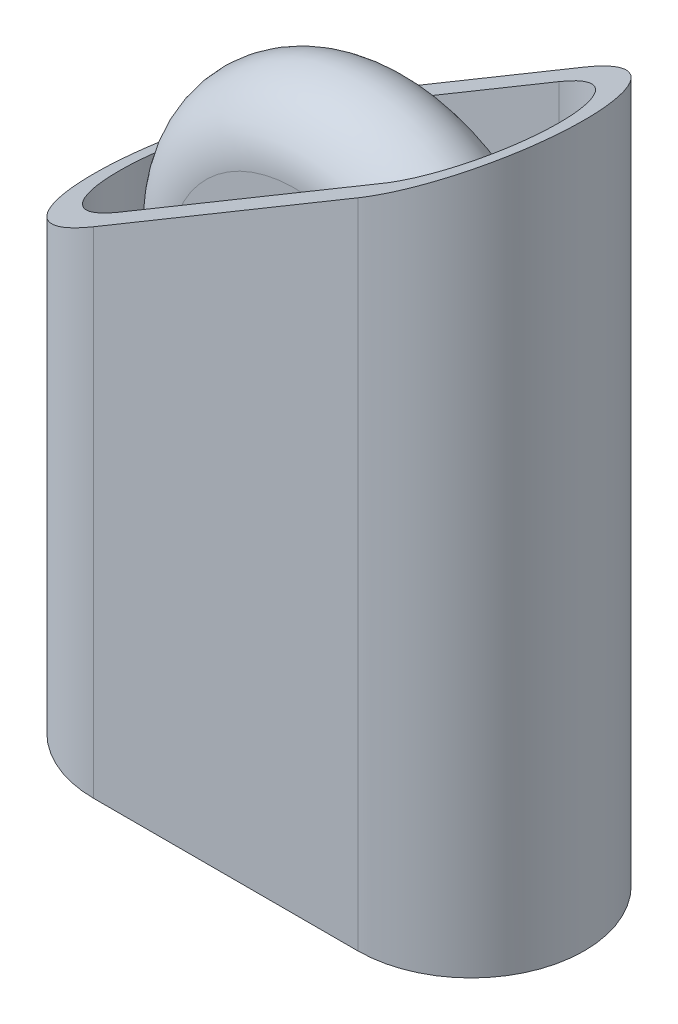
ISO-10303-21;
HEADER;
FILE_DESCRIPTION(('STEP AP214'),'2;1');
FILE_NAME('part.step','',(''),(''),'','','');
FILE_SCHEMA(('AUTOMOTIVE_DESIGN { 1 0 10303 214 1 1 1 1 }'));
ENDSEC;
DATA;
#1=APPLICATION_CONTEXT('core data for automotive mechanical design processes');
#2=APPLICATION_PROTOCOL_DEFINITION('international standard','automotive_design',2000,#1);
#3=PRODUCT_CONTEXT('',#1,'mechanical');
#4=PRODUCT('Part','Part','',(#3));
#5=PRODUCT_RELATED_PRODUCT_CATEGORY('part','',(#4));
#6=PRODUCT_DEFINITION_FORMATION('','',#4);
#7=PRODUCT_DEFINITION_CONTEXT('part definition',#1,'design');
#8=PRODUCT_DEFINITION('design','',#6,#7);
#9=PRODUCT_DEFINITION_SHAPE('','',#8);
#10=(LENGTH_UNIT() NAMED_UNIT(*) SI_UNIT(.MILLI.,.METRE.));
#11=(NAMED_UNIT(*) PLANE_ANGLE_UNIT() SI_UNIT($,.RADIAN.));
#12=(NAMED_UNIT(*) SI_UNIT($,.STERADIAN.) SOLID_ANGLE_UNIT());
#13=UNCERTAINTY_MEASURE_WITH_UNIT(LENGTH_MEASURE(1.E-05),#10,'distance_accuracy_value','');
#14=(GEOMETRIC_REPRESENTATION_CONTEXT(3) GLOBAL_UNCERTAINTY_ASSIGNED_CONTEXT((#13)) GLOBAL_UNIT_ASSIGNED_CONTEXT((#10,
#11,#12)) REPRESENTATION_CONTEXT('',''));
#15=CARTESIAN_POINT('',(0.,0.,0.));
#16=DIRECTION('',(0.,0.,1.));
#17=DIRECTION('',(1.,0.,0.));
#18=AXIS2_PLACEMENT_3D('',#15,#16,#17);
#19=CARTESIAN_POINT('',(6.,18.,0.));
#20=DIRECTION('',(0.,0.,1.));
#21=DIRECTION('',(1.,0.,0.));
#22=AXIS2_PLACEMENT_3D('',#19,#20,#21);
#23=TOROIDAL_SURFACE('',#22,5.,2.5);
#24=CARTESIAN_POINT('',(6.,18.,-2.5));
#25=DIRECTION('',(0.,0.,1.));
#26=DIRECTION('',(1.,0.,0.));
#27=AXIS2_PLACEMENT_3D('',#24,#25,#26);
#28=CIRCLE('',#27,5.);
#29=CARTESIAN_POINT('',(11.,18.,-2.5));
#30=VERTEX_POINT('',#29);
#31=EDGE_CURVE('E82',#30,#30,#28,.F.);
#32=ORIENTED_EDGE('',*,*,#31,.F.);
#33=EDGE_LOOP('',(#32));
#34=FACE_BOUND('',#33,.T.);
#35=CARTESIAN_POINT('',(6.,18.,2.5));
#36=DIRECTION('',(0.,0.,1.));
#37=DIRECTION('',(1.,0.,0.));
#38=AXIS2_PLACEMENT_3D('',#35,#36,#37);
#39=CIRCLE('',#38,5.);
#40=CARTESIAN_POINT('',(11.,18.,2.5));
#41=VERTEX_POINT('',#40);
#42=EDGE_CURVE('E12',#41,#41,#39,.T.);
#43=ORIENTED_EDGE('',*,*,#42,.F.);
#44=EDGE_LOOP('',(#43));
#45=FACE_BOUND('',#44,.T.);
#46=ADVANCED_FACE('F75',(#34,#45),#23,.T.);
#47=CARTESIAN_POINT('',(6.,18.,2.5));
#48=DIRECTION('',(0.,0.,-1.));
#49=DIRECTION('',(-1.,0.,0.));
#50=AXIS2_PLACEMENT_3D('',#47,#48,#49);
#51=CYLINDRICAL_SURFACE('',#50,3.75);
#52=CARTESIAN_POINT('',(6.,18.,2.5));
#53=DIRECTION('',(0.,0.,1.));
#54=DIRECTION('',(1.,0.,0.));
#55=AXIS2_PLACEMENT_3D('',#52,#53,#54);
#56=CIRCLE('',#55,3.75);
#57=CARTESIAN_POINT('',(9.75,18.,2.5));
#58=VERTEX_POINT('',#57);
#59=EDGE_CURVE('E86',#58,#58,#56,.T.);
#60=ORIENTED_EDGE('',*,*,#59,.T.);
#61=EDGE_LOOP('',(#60));
#62=FACE_BOUND('',#61,.T.);
#63=CARTESIAN_POINT('',(6.,18.,-2.5));
#64=DIRECTION('',(0.,0.,1.));
#65=DIRECTION('',(1.,0.,0.));
#66=AXIS2_PLACEMENT_3D('',#63,#64,#65);
#67=CIRCLE('',#66,3.75);
#68=CARTESIAN_POINT('',(9.75,18.,-2.5));
#69=VERTEX_POINT('',#68);
#70=EDGE_CURVE('E90',#69,#69,#67,.T.);
#71=ORIENTED_EDGE('',*,*,#70,.F.);
#72=EDGE_LOOP('',(#71));
#73=FACE_BOUND('',#72,.T.);
#74=ADVANCED_FACE('F98',(#62,#73),#51,.F.);
#75=CARTESIAN_POINT('',(0.,0.,2.5));
#76=DIRECTION('',(0.,0.,1.));
#77=DIRECTION('',(1.,0.,0.));
#78=AXIS2_PLACEMENT_3D('',#75,#76,#77);
#79=PLANE('',#78);
#80=ORIENTED_EDGE('',*,*,#42,.T.);
#81=EDGE_LOOP('',(#80));
#82=FACE_BOUND('',#81,.T.);
#83=ORIENTED_EDGE('',*,*,#59,.F.);
#84=EDGE_LOOP('',(#83));
#85=FACE_BOUND('',#84,.T.);
#86=ADVANCED_FACE('F100',(#82,#85),#79,.T.);
#87=CARTESIAN_POINT('',(0.,0.,-2.5));
#88=DIRECTION('',(0.,0.,1.));
#89=DIRECTION('',(1.,0.,0.));
#90=AXIS2_PLACEMENT_3D('',#87,#88,#89);
#91=PLANE('',#90);
#92=ORIENTED_EDGE('',*,*,#31,.T.);
#93=EDGE_LOOP('',(#92));
#94=FACE_BOUND('',#93,.T.);
#95=ORIENTED_EDGE('',*,*,#70,.T.);
#96=EDGE_LOOP('',(#95));
#97=FACE_BOUND('',#96,.T.);
#98=ADVANCED_FACE('F96',(#94,#97),#91,.F.);
#99=CLOSED_SHELL('',(#46,#74,#86,#98));
#100=MANIFOLD_SOLID_BREP('B2',#99);
#101=CARTESIAN_POINT('',(0.,0.,0.));
#102=DIRECTION('',(0.,1.,0.));
#103=DIRECTION('',(0.,0.,1.));
#104=AXIS2_PLACEMENT_3D('',#101,#102,#103);
#105=PLANE('',#104);
#106=CARTESIAN_POINT('',(0.,0.,0.));
#107=DIRECTION('',(0.,1.,0.));
#108=DIRECTION('',(1.,0.,0.));
#109=AXIS2_PLACEMENT_3D('',#106,#107,#108);
#110=CIRCLE('',#109,4.5);
#111=CARTESIAN_POINT('',(0.,0.,-4.5));
#112=VERTEX_POINT('',#111);
#113=CARTESIAN_POINT('',(0.,0.,4.5));
#114=VERTEX_POINT('',#113);
#115=EDGE_CURVE('E231',#112,#114,#110,.T.);
#116=ORIENTED_EDGE('',*,*,#115,.F.);
#117=DIRECTION('',(-1.,0.,0.));
#118=VECTOR('',#117,1.);
#119=CARTESIAN_POINT('',(0.,0.,-4.5));
#120=LINE('',#119,#118);
#121=CARTESIAN_POINT('',(10.5,0.,-4.5));
#122=VERTEX_POINT('',#121);
#123=EDGE_CURVE('E240',#122,#112,#120,.T.);
#124=ORIENTED_EDGE('',*,*,#123,.F.);
#125=CARTESIAN_POINT('',(10.5,0.,0.));
#126=DIRECTION('',(0.,1.,0.));
#127=DIRECTION('',(1.,0.,0.));
#128=AXIS2_PLACEMENT_3D('',#125,#126,#127);
#129=CIRCLE('',#128,4.5);
#130=CARTESIAN_POINT('',(10.5,0.,4.5));
#131=VERTEX_POINT('',#130);
#132=EDGE_CURVE('E237',#131,#122,#129,.T.);
#133=ORIENTED_EDGE('',*,*,#132,.F.);
#134=DIRECTION('',(1.,0.,0.));
#135=VECTOR('',#134,1.);
#136=CARTESIAN_POINT('',(0.,0.,4.5));
#137=LINE('',#136,#135);
#138=EDGE_CURVE('E234',#114,#131,#137,.T.);
#139=ORIENTED_EDGE('',*,*,#138,.F.);
#140=EDGE_LOOP('',(#116,#124,#133,#139));
#141=FACE_BOUND('',#140,.T.);
#142=CARTESIAN_POINT('',(0.,0.,0.));
#143=DIRECTION('',(0.,1.,0.));
#144=DIRECTION('',(0.,0.,1.));
#145=AXIS2_PLACEMENT_3D('',#142,#143,#144);
#146=CIRCLE('',#145,3.5);
#147=CARTESIAN_POINT('',(0.,0.,-3.5));
#148=VERTEX_POINT('',#147);
#149=CARTESIAN_POINT('',(0.,0.,3.5));
#150=VERTEX_POINT('',#149);
#151=EDGE_CURVE('E271',#148,#150,#146,.T.);
#152=ORIENTED_EDGE('',*,*,#151,.T.);
#153=DIRECTION('',(1.,0.,0.));
#154=VECTOR('',#153,1.);
#155=CARTESIAN_POINT('',(0.,0.,3.5));
#156=LINE('',#155,#154);
#157=CARTESIAN_POINT('',(10.5,0.,3.5));
#158=VERTEX_POINT('',#157);
#159=EDGE_CURVE('E277',#150,#158,#156,.T.);
#160=ORIENTED_EDGE('',*,*,#159,.T.);
#161=CARTESIAN_POINT('',(10.5,0.,0.));
#162=DIRECTION('',(0.,1.,0.));
#163=DIRECTION('',(0.,0.,1.));
#164=AXIS2_PLACEMENT_3D('',#161,#162,#163);
#165=CIRCLE('',#164,3.5);
#166=CARTESIAN_POINT('',(10.5,0.,-3.5));
#167=VERTEX_POINT('',#166);
#168=EDGE_CURVE('E280',#158,#167,#165,.T.);
#169=ORIENTED_EDGE('',*,*,#168,.T.);
#170=DIRECTION('',(-1.,0.,0.));
#171=VECTOR('',#170,1.);
#172=CARTESIAN_POINT('',(0.,0.,-3.5));
#173=LINE('',#172,#171);
#174=EDGE_CURVE('E221',#167,#148,#173,.T.);
#175=ORIENTED_EDGE('',*,*,#174,.T.);
#176=EDGE_LOOP('',(#152,#160,#169,#175));
#177=FACE_BOUND('',#176,.T.);
#178=ADVANCED_FACE('F140',(#141,#177),#105,.F.);
#179=CARTESIAN_POINT('',(0.,30.,0.));
#180=DIRECTION('',(0.,-1.,0.));
#181=DIRECTION('',(0.,0.,-1.));
#182=AXIS2_PLACEMENT_3D('',#179,#180,#181);
#183=CYLINDRICAL_SURFACE('',#182,4.5);
#184=CARTESIAN_POINT('',(0.,19.6769230769231,0.));
#185=DIRECTION('',(0.511251390326366,-0.859431216496909,0.));
#186=DIRECTION('',(-0.859431216496909,-0.511251390326366,0.));
#187=AXIS2_PLACEMENT_3D('',#184,#185,#186);
#188=ELLIPSE('',#187,5.23602111910975,4.5);
#189=CARTESIAN_POINT('',(0.,19.6769230769231,4.5));
#190=VERTEX_POINT('',#189);
#191=CARTESIAN_POINT('',(0.,19.6769230769231,-4.5));
#192=VERTEX_POINT('',#191);
#193=EDGE_CURVE('E262',#190,#192,#188,.T.);
#194=ORIENTED_EDGE('',*,*,#193,.T.);
#195=DIRECTION('',(0.,-1.,0.));
#196=VECTOR('',#195,1.);
#197=CARTESIAN_POINT('',(0.,30.,-4.5));
#198=LINE('',#197,#196);
#199=EDGE_CURVE('E243',#192,#112,#198,.T.);
#200=ORIENTED_EDGE('',*,*,#199,.T.);
#201=ORIENTED_EDGE('',*,*,#115,.T.);
#202=DIRECTION('',(0.,-1.,0.));
#203=VECTOR('',#202,1.);
#204=CARTESIAN_POINT('',(0.,30.,4.5));
#205=LINE('',#204,#203);
#206=EDGE_CURVE('E148',#190,#114,#205,.T.);
#207=ORIENTED_EDGE('',*,*,#206,.F.);
#208=EDGE_LOOP('',(#194,#200,#201,#207));
#209=FACE_BOUND('',#208,.T.);
#210=ADVANCED_FACE('F142',(#209),#183,.T.);
#211=CARTESIAN_POINT('',(0.,30.,4.5));
#212=DIRECTION('',(0.,0.,-1.));
#213=DIRECTION('',(-1.,0.,0.));
#214=AXIS2_PLACEMENT_3D('',#211,#212,#213);
#215=PLANE('',#214);
#216=DIRECTION('',(0.,-1.,0.));
#217=VECTOR('',#216,1.);
#218=CARTESIAN_POINT('',(10.5,30.,4.5));
#219=LINE('',#218,#217);
#220=CARTESIAN_POINT('',(10.5,25.9230769230769,4.5));
#221=VERTEX_POINT('',#220);
#222=EDGE_CURVE('E247',#221,#131,#219,.T.);
#223=ORIENTED_EDGE('',*,*,#222,.F.);
#224=DIRECTION('',(-0.859431216496909,-0.511251390326366,0.));
#225=VECTOR('',#224,1.);
#226=CARTESIAN_POINT('',(4.53580932771314,22.375148112896,4.5));
#227=LINE('',#226,#225);
#228=EDGE_CURVE('E255',#221,#190,#227,.T.);
#229=ORIENTED_EDGE('',*,*,#228,.T.);
#230=ORIENTED_EDGE('',*,*,#206,.T.);
#231=ORIENTED_EDGE('',*,*,#138,.T.);
#232=EDGE_LOOP('',(#223,#229,#230,#231));
#233=FACE_BOUND('',#232,.T.);
#234=ADVANCED_FACE('F253',(#233),#215,.F.);
#235=CARTESIAN_POINT('',(10.5,30.,0.));
#236=DIRECTION('',(0.,-1.,0.));
#237=DIRECTION('',(0.,0.,-1.));
#238=AXIS2_PLACEMENT_3D('',#235,#236,#237);
#239=CYLINDRICAL_SURFACE('',#238,4.5);
#240=CARTESIAN_POINT('',(10.5,25.9230769230769,0.));
#241=DIRECTION('',(0.511251390326366,-0.859431216496909,0.));
#242=DIRECTION('',(-0.859431216496909,-0.511251390326366,0.));
#243=AXIS2_PLACEMENT_3D('',#240,#241,#242);
#244=ELLIPSE('',#243,5.23602111910975,4.5);
#245=CARTESIAN_POINT('',(10.5,25.9230769230769,-4.5));
#246=VERTEX_POINT('',#245);
#247=EDGE_CURVE('E155',#246,#221,#244,.T.);
#248=ORIENTED_EDGE('',*,*,#247,.T.);
#249=ORIENTED_EDGE('',*,*,#222,.T.);
#250=ORIENTED_EDGE('',*,*,#132,.T.);
#251=DIRECTION('',(0.,-1.,0.));
#252=VECTOR('',#251,1.);
#253=CARTESIAN_POINT('',(10.5,30.,-4.5));
#254=LINE('',#253,#252);
#255=EDGE_CURVE('E245',#246,#122,#254,.T.);
#256=ORIENTED_EDGE('',*,*,#255,.F.);
#257=EDGE_LOOP('',(#248,#249,#250,#256));
#258=FACE_BOUND('',#257,.T.);
#259=ADVANCED_FACE('F268',(#258),#239,.T.);
#260=CARTESIAN_POINT('',(0.,30.,-4.5));
#261=DIRECTION('',(0.,0.,1.));
#262=DIRECTION('',(1.,0.,0.));
#263=AXIS2_PLACEMENT_3D('',#260,#261,#262);
#264=PLANE('',#263);
#265=ORIENTED_EDGE('',*,*,#199,.F.);
#266=DIRECTION('',(0.859431216496909,0.511251390326366,0.));
#267=VECTOR('',#266,1.);
#268=CARTESIAN_POINT('',(4.53580932771314,22.375148112896,-4.5));
#269=LINE('',#268,#267);
#270=EDGE_CURVE('E266',#192,#246,#269,.T.);
#271=ORIENTED_EDGE('',*,*,#270,.T.);
#272=ORIENTED_EDGE('',*,*,#255,.T.);
#273=ORIENTED_EDGE('',*,*,#123,.T.);
#274=EDGE_LOOP('',(#265,#271,#272,#273));
#275=FACE_BOUND('',#274,.T.);
#276=ADVANCED_FACE('F264',(#275),#264,.F.);
#277=CARTESIAN_POINT('',(0.,30.,0.));
#278=DIRECTION('',(0.,-1.,0.));
#279=DIRECTION('',(0.,0.,-1.));
#280=AXIS2_PLACEMENT_3D('',#277,#278,#279);
#281=CYLINDRICAL_SURFACE('',#280,3.5);
#282=CARTESIAN_POINT('',(0.,19.6769230769231,0.));
#283=DIRECTION('',(0.511251390326366,-0.859431216496909,0.));
#284=DIRECTION('',(-0.859431216496909,-0.511251390326366,0.));
#285=AXIS2_PLACEMENT_3D('',#282,#283,#284);
#286=ELLIPSE('',#285,4.07246087041869,3.5);
#287=CARTESIAN_POINT('',(0.,19.6769230769231,3.5));
#288=VERTEX_POINT('',#287);
#289=CARTESIAN_POINT('',(0.,19.6769230769231,-3.5));
#290=VERTEX_POINT('',#289);
#291=EDGE_CURVE('E162',#288,#290,#286,.T.);
#292=ORIENTED_EDGE('',*,*,#291,.F.);
#293=DIRECTION('',(0.,-1.,0.));
#294=VECTOR('',#293,1.);
#295=CARTESIAN_POINT('',(0.,30.,3.5));
#296=LINE('',#295,#294);
#297=EDGE_CURVE('E225',#288,#150,#296,.T.);
#298=ORIENTED_EDGE('',*,*,#297,.T.);
#299=ORIENTED_EDGE('',*,*,#151,.F.);
#300=DIRECTION('',(0.,-1.,0.));
#301=VECTOR('',#300,1.);
#302=CARTESIAN_POINT('',(0.,30.,-3.5));
#303=LINE('',#302,#301);
#304=EDGE_CURVE('E223',#290,#148,#303,.T.);
#305=ORIENTED_EDGE('',*,*,#304,.F.);
#306=EDGE_LOOP('',(#292,#298,#299,#305));
#307=FACE_BOUND('',#306,.T.);
#308=ADVANCED_FACE('F317',(#307),#281,.F.);
#309=CARTESIAN_POINT('',(0.,30.,3.5));
#310=DIRECTION('',(0.,0.,-1.));
#311=DIRECTION('',(-1.,0.,0.));
#312=AXIS2_PLACEMENT_3D('',#309,#310,#311);
#313=PLANE('',#312);
#314=CARTESIAN_POINT('',(6.,18.,3.5));
#315=DIRECTION('',(0.,0.,1.));
#316=DIRECTION('',(1.,0.,0.));
#317=AXIS2_PLACEMENT_3D('',#314,#315,#316);
#318=CIRCLE('',#317,3.5);
#319=CARTESIAN_POINT('',(9.5,18.,3.5));
#320=VERTEX_POINT('',#319);
#321=EDGE_CURVE('E217',#320,#320,#318,.T.);
#322=ORIENTED_EDGE('',*,*,#321,.T.);
#323=EDGE_LOOP('',(#322));
#324=FACE_BOUND('',#323,.T.);
#325=DIRECTION('',(-0.859431216496909,-0.511251390326366,0.));
#326=VECTOR('',#325,1.);
#327=CARTESIAN_POINT('',(4.53580932771313,22.375148112896,3.5));
#328=LINE('',#327,#326);
#329=CARTESIAN_POINT('',(10.5,25.9230769230769,3.5));
#330=VERTEX_POINT('',#329);
#331=EDGE_CURVE('E216',#330,#288,#328,.T.);
#332=ORIENTED_EDGE('',*,*,#331,.F.);
#333=DIRECTION('',(0.,-1.,0.));
#334=VECTOR('',#333,1.);
#335=CARTESIAN_POINT('',(10.5,30.,3.5));
#336=LINE('',#335,#334);
#337=EDGE_CURVE('E215',#330,#158,#336,.T.);
#338=ORIENTED_EDGE('',*,*,#337,.T.);
#339=ORIENTED_EDGE('',*,*,#159,.F.);
#340=ORIENTED_EDGE('',*,*,#297,.F.);
#341=EDGE_LOOP('',(#332,#338,#339,#340));
#342=FACE_BOUND('',#341,.T.);
#343=ADVANCED_FACE('F285',(#324,#342),#313,.T.);
#344=CARTESIAN_POINT('',(10.5,30.,0.));
#345=DIRECTION('',(0.,-1.,0.));
#346=DIRECTION('',(0.,0.,-1.));
#347=AXIS2_PLACEMENT_3D('',#344,#345,#346);
#348=CYLINDRICAL_SURFACE('',#347,3.5);
#349=CARTESIAN_POINT('',(10.5,25.9230769230769,0.));
#350=DIRECTION('',(0.511251390326366,-0.859431216496909,0.));
#351=DIRECTION('',(-0.859431216496909,-0.511251390326366,0.));
#352=AXIS2_PLACEMENT_3D('',#349,#350,#351);
#353=ELLIPSE('',#352,4.07246087041869,3.5);
#354=CARTESIAN_POINT('',(10.5,25.9230769230769,-3.5));
#355=VERTEX_POINT('',#354);
#356=EDGE_CURVE('E204',#355,#330,#353,.T.);
#357=ORIENTED_EDGE('',*,*,#356,.F.);
#358=DIRECTION('',(0.,-1.,0.));
#359=VECTOR('',#358,1.);
#360=CARTESIAN_POINT('',(10.5,30.,-3.5));
#361=LINE('',#360,#359);
#362=EDGE_CURVE('E213',#355,#167,#361,.T.);
#363=ORIENTED_EDGE('',*,*,#362,.T.);
#364=ORIENTED_EDGE('',*,*,#168,.F.);
#365=ORIENTED_EDGE('',*,*,#337,.F.);
#366=EDGE_LOOP('',(#357,#363,#364,#365));
#367=FACE_BOUND('',#366,.T.);
#368=ADVANCED_FACE('F211',(#367),#348,.F.);
#369=CARTESIAN_POINT('',(0.,30.,-3.5));
#370=DIRECTION('',(0.,0.,1.));
#371=DIRECTION('',(1.,0.,0.));
#372=AXIS2_PLACEMENT_3D('',#369,#370,#371);
#373=PLANE('',#372);
#374=CARTESIAN_POINT('',(6.,18.,-3.5));
#375=DIRECTION('',(0.,0.,1.));
#376=DIRECTION('',(1.,0.,0.));
#377=AXIS2_PLACEMENT_3D('',#374,#375,#376);
#378=CIRCLE('',#377,3.5);
#379=CARTESIAN_POINT('',(9.5,18.,-3.5));
#380=VERTEX_POINT('',#379);
#381=EDGE_CURVE('E289',#380,#380,#378,.T.);
#382=ORIENTED_EDGE('',*,*,#381,.F.);
#383=EDGE_LOOP('',(#382));
#384=FACE_BOUND('',#383,.T.);
#385=DIRECTION('',(0.859431216496909,0.511251390326366,0.));
#386=VECTOR('',#385,1.);
#387=CARTESIAN_POINT('',(4.53580932771313,22.375148112896,-3.5));
#388=LINE('',#387,#386);
#389=EDGE_CURVE('E73',#290,#355,#388,.T.);
#390=ORIENTED_EDGE('',*,*,#389,.F.);
#391=ORIENTED_EDGE('',*,*,#304,.T.);
#392=ORIENTED_EDGE('',*,*,#174,.F.);
#393=ORIENTED_EDGE('',*,*,#362,.F.);
#394=EDGE_LOOP('',(#390,#391,#392,#393));
#395=FACE_BOUND('',#394,.T.);
#396=ADVANCED_FACE('F219',(#384,#395),#373,.T.);
#397=CARTESIAN_POINT('',(-4.5,17.,-5.));
#398=DIRECTION('',(0.511251390326366,-0.859431216496909,0.));
#399=DIRECTION('',(0.859431216496909,0.511251390326366,0.));
#400=AXIS2_PLACEMENT_3D('',#397,#398,#399);
#401=PLANE('',#400);
#402=ORIENTED_EDGE('',*,*,#291,.T.);
#403=ORIENTED_EDGE('',*,*,#389,.T.);
#404=ORIENTED_EDGE('',*,*,#356,.T.);
#405=ORIENTED_EDGE('',*,*,#331,.T.);
#406=EDGE_LOOP('',(#402,#403,#404,#405));
#407=FACE_BOUND('',#406,.T.);
#408=ORIENTED_EDGE('',*,*,#193,.F.);
#409=ORIENTED_EDGE('',*,*,#228,.F.);
#410=ORIENTED_EDGE('',*,*,#247,.F.);
#411=ORIENTED_EDGE('',*,*,#270,.F.);
#412=EDGE_LOOP('',(#408,#409,#410,#411));
#413=FACE_BOUND('',#412,.T.);
#414=ADVANCED_FACE('F203',(#407,#413),#401,.F.);
#415=CARTESIAN_POINT('',(6.,18.,3.5));
#416=DIRECTION('',(0.,0.,-1.));
#417=DIRECTION('',(-1.,0.,0.));
#418=AXIS2_PLACEMENT_3D('',#415,#416,#417);
#419=CYLINDRICAL_SURFACE('',#418,3.5);
#420=ORIENTED_EDGE('',*,*,#321,.F.);
#421=EDGE_LOOP('',(#420));
#422=FACE_BOUND('',#421,.T.);
#423=ORIENTED_EDGE('',*,*,#381,.T.);
#424=EDGE_LOOP('',(#423));
#425=FACE_BOUND('',#424,.T.);
#426=ADVANCED_FACE('F296',(#422,#425),#419,.T.);
#427=CLOSED_SHELL('',(#178,#210,#234,#259,#276,#308,#343,#368,#396,#414,#426));
#428=MANIFOLD_SOLID_BREP('B7',#427);
#429=ADVANCED_BREP_SHAPE_REPRESENTATION('',(#18,#100,#428),#14);
#430=SHAPE_DEFINITION_REPRESENTATION(#9,#429);
ENDSEC;
END-ISO-10303-21;
